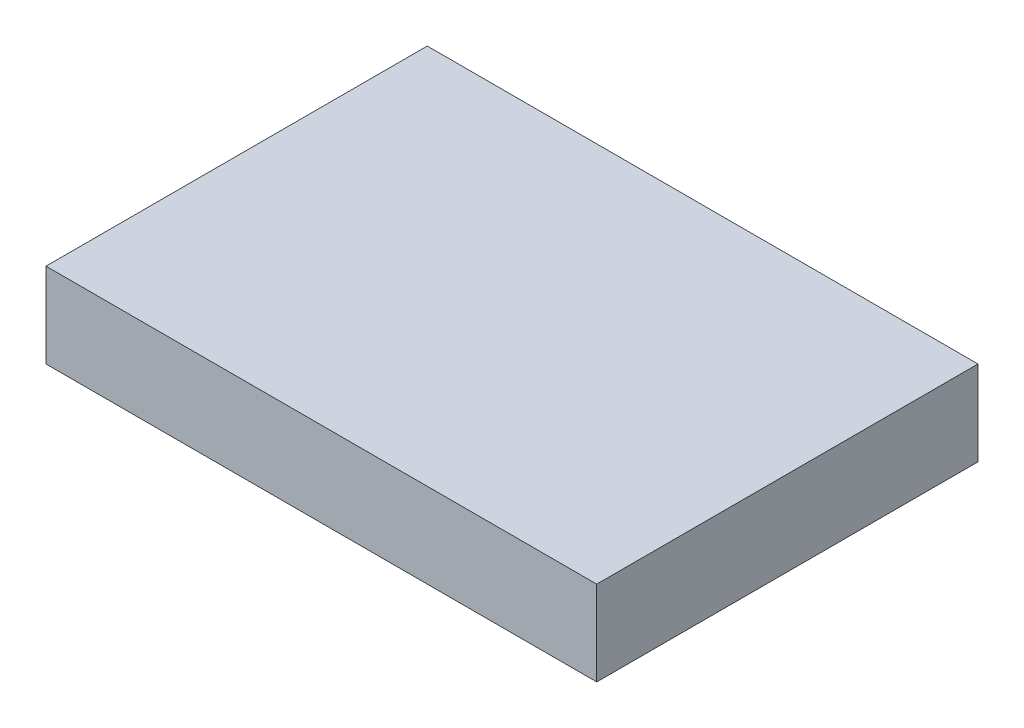
ISO-10303-21;
HEADER;
FILE_DESCRIPTION(('STEP AP214'),'2;1');
FILE_NAME('part.step','',(''),(''),'','','');
FILE_SCHEMA(('AUTOMOTIVE_DESIGN { 1 0 10303 214 1 1 1 1 }'));
ENDSEC;
DATA;
#1=APPLICATION_CONTEXT('core data for automotive mechanical design processes');
#2=APPLICATION_PROTOCOL_DEFINITION('international standard','automotive_design',2000,#1);
#3=PRODUCT_CONTEXT('',#1,'mechanical');
#4=PRODUCT('Part','Part','',(#3));
#5=PRODUCT_RELATED_PRODUCT_CATEGORY('part','',(#4));
#6=PRODUCT_DEFINITION_FORMATION('','',#4);
#7=PRODUCT_DEFINITION_CONTEXT('part definition',#1,'design');
#8=PRODUCT_DEFINITION('design','',#6,#7);
#9=PRODUCT_DEFINITION_SHAPE('','',#8);
#10=(LENGTH_UNIT() NAMED_UNIT(*) SI_UNIT(.MILLI.,.METRE.));
#11=(NAMED_UNIT(*) PLANE_ANGLE_UNIT() SI_UNIT($,.RADIAN.));
#12=(NAMED_UNIT(*) SI_UNIT($,.STERADIAN.) SOLID_ANGLE_UNIT());
#13=UNCERTAINTY_MEASURE_WITH_UNIT(LENGTH_MEASURE(1.E-05),#10,'distance_accuracy_value','');
#14=(GEOMETRIC_REPRESENTATION_CONTEXT(3) GLOBAL_UNCERTAINTY_ASSIGNED_CONTEXT((#13)) GLOBAL_UNIT_ASSIGNED_CONTEXT((#10,
#11,#12)) REPRESENTATION_CONTEXT('',''));
#15=CARTESIAN_POINT('',(0.,0.,0.));
#16=DIRECTION('',(0.,0.,1.));
#17=DIRECTION('',(1.,0.,0.));
#18=AXIS2_PLACEMENT_3D('',#15,#16,#17);
#19=CARTESIAN_POINT('',(0.,10.,0.));
#20=DIRECTION('',(1.,0.,0.));
#21=DIRECTION('',(0.,0.,-1.));
#22=AXIS2_PLACEMENT_3D('',#19,#20,#21);
#23=PLANE('',#22);
#24=DIRECTION('',(0.,0.,1.));
#25=VECTOR('',#24,1.);
#26=CARTESIAN_POINT('',(0.,0.,0.));
#27=LINE('',#26,#25);
#28=CARTESIAN_POINT('',(0.,0.,0.));
#29=VERTEX_POINT('',#28);
#30=CARTESIAN_POINT('',(0.,0.,45.));
#31=VERTEX_POINT('',#30);
#32=EDGE_CURVE('E113',#29,#31,#27,.T.);
#33=ORIENTED_EDGE('',*,*,#32,.T.);
#34=DIRECTION('',(0.,-1.,0.));
#35=VECTOR('',#34,1.);
#36=CARTESIAN_POINT('',(0.,10.,45.));
#37=LINE('',#36,#35);
#38=CARTESIAN_POINT('',(0.,10.,45.));
#39=VERTEX_POINT('',#38);
#40=EDGE_CURVE('E11',#39,#31,#37,.T.);
#41=ORIENTED_EDGE('',*,*,#40,.F.);
#42=DIRECTION('',(0.,0.,1.));
#43=VECTOR('',#42,1.);
#44=CARTESIAN_POINT('',(0.,10.,0.));
#45=LINE('',#44,#43);
#46=CARTESIAN_POINT('',(0.,10.,0.));
#47=VERTEX_POINT('',#46);
#48=EDGE_CURVE('E97',#47,#39,#45,.T.);
#49=ORIENTED_EDGE('',*,*,#48,.F.);
#50=DIRECTION('',(0.,-1.,0.));
#51=VECTOR('',#50,1.);
#52=CARTESIAN_POINT('',(0.,10.,0.));
#53=LINE('',#52,#51);
#54=EDGE_CURVE('E109',#47,#29,#53,.T.);
#55=ORIENTED_EDGE('',*,*,#54,.T.);
#56=EDGE_LOOP('',(#33,#41,#49,#55));
#57=FACE_BOUND('',#56,.T.);
#58=ADVANCED_FACE('F45',(#57),#23,.F.);
#59=CARTESIAN_POINT('',(0.,10.,45.));
#60=DIRECTION('',(0.,0.,-1.));
#61=DIRECTION('',(-1.,0.,0.));
#62=AXIS2_PLACEMENT_3D('',#59,#60,#61);
#63=PLANE('',#62);
#64=DIRECTION('',(1.,0.,0.));
#65=VECTOR('',#64,1.);
#66=CARTESIAN_POINT('',(0.,0.,45.));
#67=LINE('',#66,#65);
#68=CARTESIAN_POINT('',(65.,0.,45.));
#69=VERTEX_POINT('',#68);
#70=EDGE_CURVE('E102',#31,#69,#67,.T.);
#71=ORIENTED_EDGE('',*,*,#70,.T.);
#72=DIRECTION('',(0.,-1.,0.));
#73=VECTOR('',#72,1.);
#74=CARTESIAN_POINT('',(65.,10.,45.));
#75=LINE('',#74,#73);
#76=CARTESIAN_POINT('',(65.,10.,45.));
#77=VERTEX_POINT('',#76);
#78=EDGE_CURVE('E54',#77,#69,#75,.T.);
#79=ORIENTED_EDGE('',*,*,#78,.F.);
#80=DIRECTION('',(1.,0.,0.));
#81=VECTOR('',#80,1.);
#82=CARTESIAN_POINT('',(0.,10.,45.));
#83=LINE('',#82,#81);
#84=EDGE_CURVE('E92',#39,#77,#83,.T.);
#85=ORIENTED_EDGE('',*,*,#84,.F.);
#86=ORIENTED_EDGE('',*,*,#40,.T.);
#87=EDGE_LOOP('',(#71,#79,#85,#86));
#88=FACE_BOUND('',#87,.T.);
#89=ADVANCED_FACE('F101',(#88),#63,.F.);
#90=CARTESIAN_POINT('',(65.,10.,0.));
#91=DIRECTION('',(-1.,0.,0.));
#92=DIRECTION('',(0.,0.,1.));
#93=AXIS2_PLACEMENT_3D('',#90,#91,#92);
#94=PLANE('',#93);
#95=DIRECTION('',(0.,0.,-1.));
#96=VECTOR('',#95,1.);
#97=CARTESIAN_POINT('',(65.,0.,0.));
#98=LINE('',#97,#96);
#99=CARTESIAN_POINT('',(65.,0.,0.));
#100=VERTEX_POINT('',#99);
#101=EDGE_CURVE('E79',#69,#100,#98,.T.);
#102=ORIENTED_EDGE('',*,*,#101,.T.);
#103=DIRECTION('',(0.,-1.,0.));
#104=VECTOR('',#103,1.);
#105=CARTESIAN_POINT('',(65.,10.,0.));
#106=LINE('',#105,#104);
#107=CARTESIAN_POINT('',(65.,10.,0.));
#108=VERTEX_POINT('',#107);
#109=EDGE_CURVE('E104',#108,#100,#106,.T.);
#110=ORIENTED_EDGE('',*,*,#109,.F.);
#111=DIRECTION('',(0.,0.,-1.));
#112=VECTOR('',#111,1.);
#113=CARTESIAN_POINT('',(65.,10.,0.));
#114=LINE('',#113,#112);
#115=EDGE_CURVE('E95',#77,#108,#114,.T.);
#116=ORIENTED_EDGE('',*,*,#115,.F.);
#117=ORIENTED_EDGE('',*,*,#78,.T.);
#118=EDGE_LOOP('',(#102,#110,#116,#117));
#119=FACE_BOUND('',#118,.T.);
#120=ADVANCED_FACE('F105',(#119),#94,.F.);
#121=CARTESIAN_POINT('',(0.,10.,0.));
#122=DIRECTION('',(0.,0.,1.));
#123=DIRECTION('',(1.,0.,0.));
#124=AXIS2_PLACEMENT_3D('',#121,#122,#123);
#125=PLANE('',#124);
#126=DIRECTION('',(-1.,0.,0.));
#127=VECTOR('',#126,1.);
#128=CARTESIAN_POINT('',(0.,0.,0.));
#129=LINE('',#128,#127);
#130=EDGE_CURVE('E85',#100,#29,#129,.T.);
#131=ORIENTED_EDGE('',*,*,#130,.T.);
#132=ORIENTED_EDGE('',*,*,#54,.F.);
#133=DIRECTION('',(-1.,0.,0.));
#134=VECTOR('',#133,1.);
#135=CARTESIAN_POINT('',(0.,10.,0.));
#136=LINE('',#135,#134);
#137=EDGE_CURVE('E62',#108,#47,#136,.T.);
#138=ORIENTED_EDGE('',*,*,#137,.F.);
#139=ORIENTED_EDGE('',*,*,#109,.T.);
#140=EDGE_LOOP('',(#131,#132,#138,#139));
#141=FACE_BOUND('',#140,.T.);
#142=ADVANCED_FACE('F126',(#141),#125,.F.);
#143=CARTESIAN_POINT('',(0.,10.,0.));
#144=DIRECTION('',(0.,1.,0.));
#145=DIRECTION('',(0.,0.,1.));
#146=AXIS2_PLACEMENT_3D('',#143,#144,#145);
#147=PLANE('',#146);
#148=ORIENTED_EDGE('',*,*,#48,.T.);
#149=ORIENTED_EDGE('',*,*,#84,.T.);
#150=ORIENTED_EDGE('',*,*,#115,.T.);
#151=ORIENTED_EDGE('',*,*,#137,.T.);
#152=EDGE_LOOP('',(#148,#149,#150,#151));
#153=FACE_BOUND('',#152,.T.);
#154=ADVANCED_FACE('F93',(#153),#147,.T.);
#155=CARTESIAN_POINT('',(0.,0.,0.));
#156=DIRECTION('',(0.,1.,0.));
#157=DIRECTION('',(0.,0.,1.));
#158=AXIS2_PLACEMENT_3D('',#155,#156,#157);
#159=PLANE('',#158);
#160=ORIENTED_EDGE('',*,*,#32,.F.);
#161=ORIENTED_EDGE('',*,*,#130,.F.);
#162=ORIENTED_EDGE('',*,*,#101,.F.);
#163=ORIENTED_EDGE('',*,*,#70,.F.);
#164=EDGE_LOOP('',(#160,#161,#162,#163));
#165=FACE_BOUND('',#164,.T.);
#166=ADVANCED_FACE('F129',(#165),#159,.F.);
#167=CLOSED_SHELL('',(#58,#89,#120,#142,#154,#166));
#168=MANIFOLD_SOLID_BREP('B2',#167);
#169=ADVANCED_BREP_SHAPE_REPRESENTATION('',(#18,#168),#14);
#170=SHAPE_DEFINITION_REPRESENTATION(#9,#169);
ENDSEC;
END-ISO-10303-21;
